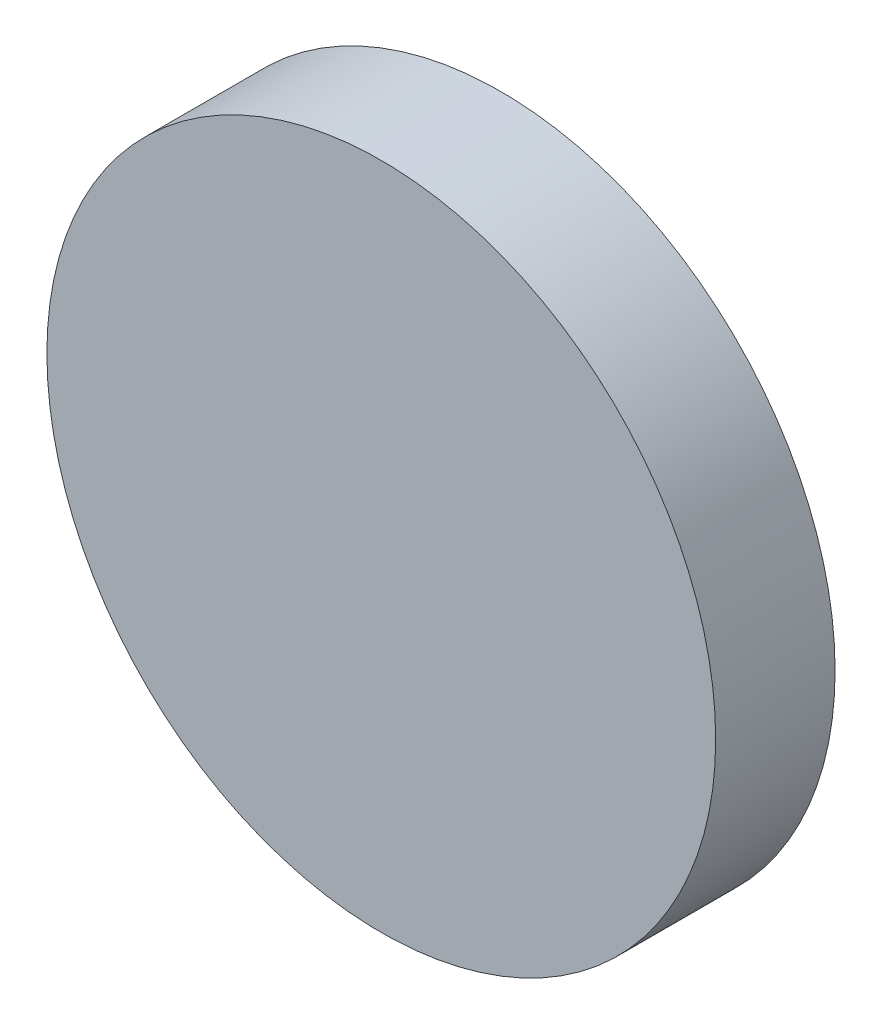
ISO-10303-21;
HEADER;
FILE_DESCRIPTION(('STEP AP214'),'2;1');
FILE_NAME('part.step','',(''),(''),'','','');
FILE_SCHEMA(('AUTOMOTIVE_DESIGN { 1 0 10303 214 1 1 1 1 }'));
ENDSEC;
DATA;
#1=APPLICATION_CONTEXT('core data for automotive mechanical design processes');
#2=APPLICATION_PROTOCOL_DEFINITION('international standard','automotive_design',2000,#1);
#3=PRODUCT_CONTEXT('',#1,'mechanical');
#4=PRODUCT('Part','Part','',(#3));
#5=PRODUCT_RELATED_PRODUCT_CATEGORY('part','',(#4));
#6=PRODUCT_DEFINITION_FORMATION('','',#4);
#7=PRODUCT_DEFINITION_CONTEXT('part definition',#1,'design');
#8=PRODUCT_DEFINITION('design','',#6,#7);
#9=PRODUCT_DEFINITION_SHAPE('','',#8);
#10=(LENGTH_UNIT() NAMED_UNIT(*) SI_UNIT(.MILLI.,.METRE.));
#11=(NAMED_UNIT(*) PLANE_ANGLE_UNIT() SI_UNIT($,.RADIAN.));
#12=(NAMED_UNIT(*) SI_UNIT($,.STERADIAN.) SOLID_ANGLE_UNIT());
#13=UNCERTAINTY_MEASURE_WITH_UNIT(LENGTH_MEASURE(1.E-05),#10,'distance_accuracy_value','');
#14=(GEOMETRIC_REPRESENTATION_CONTEXT(3) GLOBAL_UNCERTAINTY_ASSIGNED_CONTEXT((#13)) GLOBAL_UNIT_ASSIGNED_CONTEXT((#10,
#11,#12)) REPRESENTATION_CONTEXT('',''));
#15=CARTESIAN_POINT('',(0.,0.,0.));
#16=DIRECTION('',(0.,0.,1.));
#17=DIRECTION('',(1.,0.,0.));
#18=AXIS2_PLACEMENT_3D('',#15,#16,#17);
#19=CARTESIAN_POINT('',(0.,0.,-48.2102458339995));
#20=DIRECTION('',(0.,0.,1.));
#21=DIRECTION('',(1.,0.,0.));
#22=AXIS2_PLACEMENT_3D('',#19,#20,#21);
#23=PLANE('',#22);
#24=CARTESIAN_POINT('',(0.,0.,-48.2102458339995));
#25=DIRECTION('',(0.,0.,-1.));
#26=DIRECTION('',(-1.,0.,0.));
#27=AXIS2_PLACEMENT_3D('',#24,#25,#26);
#28=CIRCLE('',#27,10.);
#29=CARTESIAN_POINT('',(-10.,0.,-48.2102458339995));
#30=VERTEX_POINT('',#29);
#31=EDGE_CURVE('E11',#30,#30,#28,.T.);
#32=ORIENTED_EDGE('',*,*,#31,.F.);
#33=EDGE_LOOP('',(#32));
#34=FACE_BOUND('',#33,.T.);
#35=CARTESIAN_POINT('',(0.,0.,-48.2102458339995));
#36=DIRECTION('',(0.,0.,-1.));
#37=DIRECTION('',(-1.,0.,0.));
#38=AXIS2_PLACEMENT_3D('',#35,#36,#37);
#39=CIRCLE('',#38,12.);
#40=CARTESIAN_POINT('',(-12.,0.,-48.2102458339995));
#41=VERTEX_POINT('',#40);
#42=EDGE_CURVE('E192',#41,#41,#39,.T.);
#43=ORIENTED_EDGE('',*,*,#42,.T.);
#44=EDGE_LOOP('',(#43));
#45=FACE_BOUND('',#44,.T.);
#46=ADVANCED_FACE('F45',(#34,#45),#23,.F.);
#47=CARTESIAN_POINT('',(0.,0.,-58.0082048051322));
#48=DIRECTION('',(0.,0.,-1.));
#49=DIRECTION('',(1.,0.,0.));
#50=AXIS2_PLACEMENT_3D('',#47,#48,#49);
#51=SPHERICAL_SURFACE('',#50,14.);
#52=ORIENTED_EDGE('',*,*,#31,.T.);
#53=EDGE_LOOP('',(#52));
#54=FACE_BOUND('',#53,.T.);
#55=ADVANCED_FACE('F305',(#54),#51,.F.);
#56=CARTESIAN_POINT('',(0.,0.,-43.7102458339995));
#57=DIRECTION('',(0.,0.,1.));
#58=DIRECTION('',(1.,0.,0.));
#59=AXIS2_PLACEMENT_3D('',#56,#57,#58);
#60=PLANE('',#59);
#61=CARTESIAN_POINT('',(0.,0.,-43.7102458339995));
#62=DIRECTION('',(0.,0.,-1.));
#63=DIRECTION('',(-1.,0.,0.));
#64=AXIS2_PLACEMENT_3D('',#61,#62,#63);
#65=CIRCLE('',#64,14.);
#66=CARTESIAN_POINT('',(-14.,0.,-43.7102458339995));
#67=VERTEX_POINT('',#66);
#68=EDGE_CURVE('E52',#67,#67,#65,.T.);
#69=ORIENTED_EDGE('',*,*,#68,.F.);
#70=EDGE_LOOP('',(#69));
#71=FACE_BOUND('',#70,.T.);
#72=ADVANCED_FACE('F303',(#71),#60,.T.);
#73=CARTESIAN_POINT('',(0.,0.,-48.7102458339995));
#74=DIRECTION('',(0.,0.,-1.));
#75=DIRECTION('',(-1.,0.,0.));
#76=AXIS2_PLACEMENT_3D('',#73,#74,#75);
#77=CYLINDRICAL_SURFACE('',#76,14.);
#78=ORIENTED_EDGE('',*,*,#68,.T.);
#79=EDGE_LOOP('',(#78));
#80=FACE_BOUND('',#79,.T.);
#81=CARTESIAN_POINT('',(0.,0.,-48.7102458339995));
#82=DIRECTION('',(0.,0.,-1.));
#83=DIRECTION('',(-1.,0.,0.));
#84=AXIS2_PLACEMENT_3D('',#81,#82,#83);
#85=CIRCLE('',#84,14.);
#86=CARTESIAN_POINT('',(-14.,0.,-48.7102458339995));
#87=VERTEX_POINT('',#86);
#88=EDGE_CURVE('E295',#87,#87,#85,.T.);
#89=ORIENTED_EDGE('',*,*,#88,.F.);
#90=EDGE_LOOP('',(#89));
#91=FACE_BOUND('',#90,.T.);
#92=ADVANCED_FACE('F300',(#80,#91),#77,.T.);
#93=CARTESIAN_POINT('',(0.,0.,-48.7102458339995));
#94=DIRECTION('',(0.,0.,-1.));
#95=DIRECTION('',(-1.,0.,0.));
#96=AXIS2_PLACEMENT_3D('',#93,#94,#95);
#97=PLANE('',#96);
#98=DIRECTION('',(0.,1.,0.));
#99=VECTOR('',#98,1.);
#100=CARTESIAN_POINT('',(12.4,-1.25,-48.7102458339995));
#101=LINE('',#100,#99);
#102=CARTESIAN_POINT('',(12.4,-1.25,-48.7102458339995));
#103=VERTEX_POINT('',#102);
#104=CARTESIAN_POINT('',(12.4,1.25,-48.7102458339995));
#105=VERTEX_POINT('',#104);
#106=EDGE_CURVE('E59',#103,#105,#101,.T.);
#107=ORIENTED_EDGE('',*,*,#106,.F.);
#108=DIRECTION('',(-1.,0.,0.));
#109=VECTOR('',#108,1.);
#110=CARTESIAN_POINT('',(13.6,-1.25,-48.7102458339995));
#111=LINE('',#110,#109);
#112=CARTESIAN_POINT('',(13.6,-1.25,-48.7102458339995));
#113=VERTEX_POINT('',#112);
#114=EDGE_CURVE('E177',#113,#103,#111,.T.);
#115=ORIENTED_EDGE('',*,*,#114,.F.);
#116=DIRECTION('',(0.,-1.,0.));
#117=VECTOR('',#116,1.);
#118=CARTESIAN_POINT('',(13.6,-1.25,-48.7102458339995));
#119=LINE('',#118,#117);
#120=CARTESIAN_POINT('',(13.6,1.25,-48.7102458339995));
#121=VERTEX_POINT('',#120);
#122=EDGE_CURVE('E180',#121,#113,#119,.T.);
#123=ORIENTED_EDGE('',*,*,#122,.F.);
#124=DIRECTION('',(1.,0.,0.));
#125=VECTOR('',#124,1.);
#126=CARTESIAN_POINT('',(13.6,1.25,-48.7102458339995));
#127=LINE('',#126,#125);
#128=EDGE_CURVE('E186',#105,#121,#127,.T.);
#129=ORIENTED_EDGE('',*,*,#128,.F.);
#130=EDGE_LOOP('',(#107,#115,#123,#129));
#131=FACE_BOUND('',#130,.T.);
#132=DIRECTION('',(0.,1.,0.));
#133=VECTOR('',#132,1.);
#134=CARTESIAN_POINT('',(-1.25000000000004,13.6,-48.7102458339995));
#135=LINE('',#134,#133);
#136=CARTESIAN_POINT('',(-1.25000000000004,12.4,-48.7102458339995));
#137=VERTEX_POINT('',#136);
#138=CARTESIAN_POINT('',(-1.25000000000004,13.6,-48.7102458339995));
#139=VERTEX_POINT('',#138);
#140=EDGE_CURVE('E67',#137,#139,#135,.T.);
#141=ORIENTED_EDGE('',*,*,#140,.F.);
#142=DIRECTION('',(-1.,0.,0.));
#143=VECTOR('',#142,1.);
#144=CARTESIAN_POINT('',(1.24999999999996,12.4,-48.7102458339995));
#145=LINE('',#144,#143);
#146=CARTESIAN_POINT('',(1.24999999999996,12.4,-48.7102458339995));
#147=VERTEX_POINT('',#146);
#148=EDGE_CURVE('E206',#147,#137,#145,.T.);
#149=ORIENTED_EDGE('',*,*,#148,.F.);
#150=DIRECTION('',(0.,-1.,0.));
#151=VECTOR('',#150,1.);
#152=CARTESIAN_POINT('',(1.24999999999996,13.6,-48.7102458339995));
#153=LINE('',#152,#151);
#154=CARTESIAN_POINT('',(1.24999999999996,13.6,-48.7102458339995));
#155=VERTEX_POINT('',#154);
#156=EDGE_CURVE('E209',#155,#147,#153,.T.);
#157=ORIENTED_EDGE('',*,*,#156,.F.);
#158=DIRECTION('',(1.,0.,0.));
#159=VECTOR('',#158,1.);
#160=CARTESIAN_POINT('',(1.24999999999996,13.6,-48.7102458339995));
#161=LINE('',#160,#159);
#162=EDGE_CURVE('E213',#139,#155,#161,.T.);
#163=ORIENTED_EDGE('',*,*,#162,.F.);
#164=EDGE_LOOP('',(#141,#149,#157,#163));
#165=FACE_BOUND('',#164,.T.);
#166=DIRECTION('',(-1.,0.,0.));
#167=VECTOR('',#166,1.);
#168=CARTESIAN_POINT('',(-13.6,-1.2500000000001,-48.7102458339995));
#169=LINE('',#168,#167);
#170=CARTESIAN_POINT('',(-12.4,-1.25000000000009,-48.7102458339995));
#171=VERTEX_POINT('',#170);
#172=CARTESIAN_POINT('',(-13.6,-1.2500000000001,-48.7102458339995));
#173=VERTEX_POINT('',#172);
#174=EDGE_CURVE('E205',#171,#173,#169,.T.);
#175=ORIENTED_EDGE('',*,*,#174,.F.);
#176=DIRECTION('',(0.,-1.,0.));
#177=VECTOR('',#176,1.);
#178=CARTESIAN_POINT('',(-12.4,1.24999999999991,-48.7102458339995));
#179=LINE('',#178,#177);
#180=CARTESIAN_POINT('',(-12.4,1.24999999999991,-48.7102458339995));
#181=VERTEX_POINT('',#180);
#182=EDGE_CURVE('E238',#181,#171,#179,.T.);
#183=ORIENTED_EDGE('',*,*,#182,.F.);
#184=DIRECTION('',(1.,0.,0.));
#185=VECTOR('',#184,1.);
#186=CARTESIAN_POINT('',(-13.6,1.2499999999999,-48.7102458339995));
#187=LINE('',#186,#185);
#188=CARTESIAN_POINT('',(-13.6,1.2499999999999,-48.7102458339995));
#189=VERTEX_POINT('',#188);
#190=EDGE_CURVE('E241',#189,#181,#187,.T.);
#191=ORIENTED_EDGE('',*,*,#190,.F.);
#192=DIRECTION('',(0.,1.,0.));
#193=VECTOR('',#192,1.);
#194=CARTESIAN_POINT('',(-13.6,1.2499999999999,-48.7102458339995));
#195=LINE('',#194,#193);
#196=EDGE_CURVE('E245',#173,#189,#195,.T.);
#197=ORIENTED_EDGE('',*,*,#196,.F.);
#198=EDGE_LOOP('',(#175,#183,#191,#197));
#199=FACE_BOUND('',#198,.T.);
#200=DIRECTION('',(0.,-1.,0.));
#201=VECTOR('',#200,1.);
#202=CARTESIAN_POINT('',(1.25000000000015,-13.6,-48.7102458339995));
#203=LINE('',#202,#201);
#204=CARTESIAN_POINT('',(1.25000000000014,-12.4,-48.7102458339995));
#205=VERTEX_POINT('',#204);
#206=CARTESIAN_POINT('',(1.25000000000015,-13.6,-48.7102458339995));
#207=VERTEX_POINT('',#206);
#208=EDGE_CURVE('E237',#205,#207,#203,.T.);
#209=ORIENTED_EDGE('',*,*,#208,.F.);
#210=DIRECTION('',(1.,0.,0.));
#211=VECTOR('',#210,1.);
#212=CARTESIAN_POINT('',(-1.24999999999986,-12.4,-48.7102458339995));
#213=LINE('',#212,#211);
#214=CARTESIAN_POINT('',(-1.24999999999986,-12.4,-48.7102458339995));
#215=VERTEX_POINT('',#214);
#216=EDGE_CURVE('E269',#215,#205,#213,.T.);
#217=ORIENTED_EDGE('',*,*,#216,.F.);
#218=DIRECTION('',(0.,1.,0.));
#219=VECTOR('',#218,1.);
#220=CARTESIAN_POINT('',(-1.24999999999985,-13.6,-48.7102458339995));
#221=LINE('',#220,#219);
#222=CARTESIAN_POINT('',(-1.24999999999985,-13.6,-48.7102458339995));
#223=VERTEX_POINT('',#222);
#224=EDGE_CURVE('E272',#223,#215,#221,.T.);
#225=ORIENTED_EDGE('',*,*,#224,.F.);
#226=DIRECTION('',(-1.,0.,0.));
#227=VECTOR('',#226,1.);
#228=CARTESIAN_POINT('',(-1.24999999999985,-13.6,-48.7102458339995));
#229=LINE('',#228,#227);
#230=EDGE_CURVE('E276',#207,#223,#229,.T.);
#231=ORIENTED_EDGE('',*,*,#230,.F.);
#232=EDGE_LOOP('',(#209,#217,#225,#231));
#233=FACE_BOUND('',#232,.T.);
#234=ORIENTED_EDGE('',*,*,#88,.T.);
#235=EDGE_LOOP('',(#234));
#236=FACE_BOUND('',#235,.T.);
#237=CARTESIAN_POINT('',(0.,0.,-48.7102458339995));
#238=DIRECTION('',(0.,0.,-1.));
#239=DIRECTION('',(-1.,0.,0.));
#240=AXIS2_PLACEMENT_3D('',#237,#238,#239);
#241=CIRCLE('',#240,12.);
#242=CARTESIAN_POINT('',(-12.,0.,-48.7102458339995));
#243=VERTEX_POINT('',#242);
#244=EDGE_CURVE('E292',#243,#243,#241,.T.);
#245=ORIENTED_EDGE('',*,*,#244,.F.);
#246=EDGE_LOOP('',(#245));
#247=FACE_BOUND('',#246,.T.);
#248=ADVANCED_FACE('F311',(#131,#165,#199,#233,#236,#247),#97,.T.);
#249=CARTESIAN_POINT('',(0.,0.,-48.7102458339995));
#250=DIRECTION('',(0.,0.,-1.));
#251=DIRECTION('',(-1.,0.,0.));
#252=AXIS2_PLACEMENT_3D('',#249,#250,#251);
#253=CYLINDRICAL_SURFACE('',#252,12.);
#254=ORIENTED_EDGE('',*,*,#42,.F.);
#255=EDGE_LOOP('',(#254));
#256=FACE_BOUND('',#255,.T.);
#257=ORIENTED_EDGE('',*,*,#244,.T.);
#258=EDGE_LOOP('',(#257));
#259=FACE_BOUND('',#258,.T.);
#260=ADVANCED_FACE('F322',(#256,#259),#253,.F.);
#261=CARTESIAN_POINT('',(1.25000000000015,-13.6,-44.7102458339995));
#262=DIRECTION('',(1.,0.,0.));
#263=DIRECTION('',(0.,1.,0.));
#264=AXIS2_PLACEMENT_3D('',#261,#262,#263);
#265=PLANE('',#264);
#266=ORIENTED_EDGE('',*,*,#208,.T.);
#267=DIRECTION('',(0.,0.,-1.));
#268=VECTOR('',#267,1.);
#269=CARTESIAN_POINT('',(1.25000000000015,-13.6,-44.7102458339995));
#270=LINE('',#269,#268);
#271=CARTESIAN_POINT('',(1.25000000000015,-13.6,-44.7102458339995));
#272=VERTEX_POINT('',#271);
#273=EDGE_CURVE('E259',#272,#207,#270,.T.);
#274=ORIENTED_EDGE('',*,*,#273,.F.);
#275=DIRECTION('',(0.,-1.,0.));
#276=VECTOR('',#275,1.);
#277=CARTESIAN_POINT('',(1.25000000000015,-13.6,-44.7102458339995));
#278=LINE('',#277,#276);
#279=CARTESIAN_POINT('',(1.25000000000014,-12.4,-44.7102458339995));
#280=VERTEX_POINT('',#279);
#281=EDGE_CURVE('E273',#280,#272,#278,.T.);
#282=ORIENTED_EDGE('',*,*,#281,.F.);
#283=DIRECTION('',(0.,0.,-1.));
#284=VECTOR('',#283,1.);
#285=CARTESIAN_POINT('',(1.25000000000014,-12.4,-44.7102458339995));
#286=LINE('',#285,#284);
#287=EDGE_CURVE('E267',#280,#205,#286,.T.);
#288=ORIENTED_EDGE('',*,*,#287,.T.);
#289=EDGE_LOOP('',(#266,#274,#282,#288));
#290=FACE_BOUND('',#289,.T.);
#291=ADVANCED_FACE('F325',(#290),#265,.F.);
#292=CARTESIAN_POINT('',(-1.24999999999986,-12.4,-44.7102458339995));
#293=DIRECTION('',(0.,1.,0.));
#294=DIRECTION('',(-1.,0.,0.));
#295=AXIS2_PLACEMENT_3D('',#292,#293,#294);
#296=PLANE('',#295);
#297=ORIENTED_EDGE('',*,*,#216,.T.);
#298=ORIENTED_EDGE('',*,*,#287,.F.);
#299=DIRECTION('',(1.,0.,0.));
#300=VECTOR('',#299,1.);
#301=CARTESIAN_POINT('',(-1.24999999999986,-12.4,-44.7102458339995));
#302=LINE('',#301,#300);
#303=CARTESIAN_POINT('',(-1.24999999999986,-12.4,-44.7102458339995));
#304=VERTEX_POINT('',#303);
#305=EDGE_CURVE('E262',#304,#280,#302,.T.);
#306=ORIENTED_EDGE('',*,*,#305,.F.);
#307=DIRECTION('',(0.,0.,-1.));
#308=VECTOR('',#307,1.);
#309=CARTESIAN_POINT('',(-1.24999999999986,-12.4,-44.7102458339995));
#310=LINE('',#309,#308);
#311=EDGE_CURVE('E265',#304,#215,#310,.T.);
#312=ORIENTED_EDGE('',*,*,#311,.T.);
#313=EDGE_LOOP('',(#297,#298,#306,#312));
#314=FACE_BOUND('',#313,.T.);
#315=ADVANCED_FACE('F343',(#314),#296,.F.);
#316=CARTESIAN_POINT('',(-1.24999999999985,-13.6,-44.7102458339995));
#317=DIRECTION('',(-1.,0.,0.));
#318=DIRECTION('',(0.,-1.,0.));
#319=AXIS2_PLACEMENT_3D('',#316,#317,#318);
#320=PLANE('',#319);
#321=ORIENTED_EDGE('',*,*,#224,.T.);
#322=ORIENTED_EDGE('',*,*,#311,.F.);
#323=DIRECTION('',(0.,1.,0.));
#324=VECTOR('',#323,1.);
#325=CARTESIAN_POINT('',(-1.24999999999985,-13.6,-44.7102458339995));
#326=LINE('',#325,#324);
#327=CARTESIAN_POINT('',(-1.24999999999985,-13.6,-44.7102458339995));
#328=VERTEX_POINT('',#327);
#329=EDGE_CURVE('E282',#328,#304,#326,.T.);
#330=ORIENTED_EDGE('',*,*,#329,.F.);
#331=DIRECTION('',(0.,0.,-1.));
#332=VECTOR('',#331,1.);
#333=CARTESIAN_POINT('',(-1.24999999999985,-13.6,-44.7102458339995));
#334=LINE('',#333,#332);
#335=EDGE_CURVE('E263',#328,#223,#334,.T.);
#336=ORIENTED_EDGE('',*,*,#335,.T.);
#337=EDGE_LOOP('',(#321,#322,#330,#336));
#338=FACE_BOUND('',#337,.T.);
#339=ADVANCED_FACE('F346',(#338),#320,.F.);
#340=CARTESIAN_POINT('',(-1.24999999999985,-13.6,-44.7102458339995));
#341=DIRECTION('',(0.,-1.,0.));
#342=DIRECTION('',(1.,0.,0.));
#343=AXIS2_PLACEMENT_3D('',#340,#341,#342);
#344=PLANE('',#343);
#345=ORIENTED_EDGE('',*,*,#230,.T.);
#346=ORIENTED_EDGE('',*,*,#335,.F.);
#347=DIRECTION('',(-1.,0.,0.));
#348=VECTOR('',#347,1.);
#349=CARTESIAN_POINT('',(-1.24999999999985,-13.6,-44.7102458339995));
#350=LINE('',#349,#348);
#351=EDGE_CURVE('E285',#272,#328,#350,.T.);
#352=ORIENTED_EDGE('',*,*,#351,.F.);
#353=ORIENTED_EDGE('',*,*,#273,.T.);
#354=EDGE_LOOP('',(#345,#346,#352,#353));
#355=FACE_BOUND('',#354,.T.);
#356=ADVANCED_FACE('F341',(#355),#344,.F.);
#357=CARTESIAN_POINT('',(0.,0.,-44.7102458339995));
#358=DIRECTION('',(0.,0.,-1.));
#359=DIRECTION('',(-1.,0.,0.));
#360=AXIS2_PLACEMENT_3D('',#357,#358,#359);
#361=PLANE('',#360);
#362=ORIENTED_EDGE('',*,*,#281,.T.);
#363=ORIENTED_EDGE('',*,*,#351,.T.);
#364=ORIENTED_EDGE('',*,*,#329,.T.);
#365=ORIENTED_EDGE('',*,*,#305,.T.);
#366=EDGE_LOOP('',(#362,#363,#364,#365));
#367=FACE_BOUND('',#366,.T.);
#368=ADVANCED_FACE('F337',(#367),#361,.T.);
#369=CARTESIAN_POINT('',(-13.6,-1.2500000000001,-44.7102458339995));
#370=DIRECTION('',(0.,-1.,0.));
#371=DIRECTION('',(1.,0.,0.));
#372=AXIS2_PLACEMENT_3D('',#369,#370,#371);
#373=PLANE('',#372);
#374=ORIENTED_EDGE('',*,*,#174,.T.);
#375=DIRECTION('',(0.,0.,-1.));
#376=VECTOR('',#375,1.);
#377=CARTESIAN_POINT('',(-13.6,-1.2500000000001,-44.7102458339995));
#378=LINE('',#377,#376);
#379=CARTESIAN_POINT('',(-13.6,-1.2500000000001,-44.7102458339995));
#380=VERTEX_POINT('',#379);
#381=EDGE_CURVE('E227',#380,#173,#378,.T.);
#382=ORIENTED_EDGE('',*,*,#381,.F.);
#383=DIRECTION('',(-1.,0.,0.));
#384=VECTOR('',#383,1.);
#385=CARTESIAN_POINT('',(-13.6,-1.2500000000001,-44.7102458339995));
#386=LINE('',#385,#384);
#387=CARTESIAN_POINT('',(-12.4,-1.25000000000009,-44.7102458339995));
#388=VERTEX_POINT('',#387);
#389=EDGE_CURVE('E242',#388,#380,#386,.T.);
#390=ORIENTED_EDGE('',*,*,#389,.F.);
#391=DIRECTION('',(0.,0.,-1.));
#392=VECTOR('',#391,1.);
#393=CARTESIAN_POINT('',(-12.4,-1.25000000000009,-44.7102458339995));
#394=LINE('',#393,#392);
#395=EDGE_CURVE('E235',#388,#171,#394,.T.);
#396=ORIENTED_EDGE('',*,*,#395,.T.);
#397=EDGE_LOOP('',(#374,#382,#390,#396));
#398=FACE_BOUND('',#397,.T.);
#399=ADVANCED_FACE('F340',(#398),#373,.F.);
#400=CARTESIAN_POINT('',(-12.4,1.24999999999991,-44.7102458339995));
#401=DIRECTION('',(1.,0.,0.));
#402=DIRECTION('',(0.,1.,0.));
#403=AXIS2_PLACEMENT_3D('',#400,#401,#402);
#404=PLANE('',#403);
#405=ORIENTED_EDGE('',*,*,#182,.T.);
#406=ORIENTED_EDGE('',*,*,#395,.F.);
#407=DIRECTION('',(0.,-1.,0.));
#408=VECTOR('',#407,1.);
#409=CARTESIAN_POINT('',(-12.4,1.24999999999991,-44.7102458339995));
#410=LINE('',#409,#408);
#411=CARTESIAN_POINT('',(-12.4,1.24999999999991,-44.7102458339995));
#412=VERTEX_POINT('',#411);
#413=EDGE_CURVE('E230',#412,#388,#410,.T.);
#414=ORIENTED_EDGE('',*,*,#413,.F.);
#415=DIRECTION('',(0.,0.,-1.));
#416=VECTOR('',#415,1.);
#417=CARTESIAN_POINT('',(-12.4,1.24999999999991,-44.7102458339995));
#418=LINE('',#417,#416);
#419=EDGE_CURVE('E233',#412,#181,#418,.T.);
#420=ORIENTED_EDGE('',*,*,#419,.T.);
#421=EDGE_LOOP('',(#405,#406,#414,#420));
#422=FACE_BOUND('',#421,.T.);
#423=ADVANCED_FACE('F362',(#422),#404,.F.);
#424=CARTESIAN_POINT('',(-13.6,1.2499999999999,-44.7102458339995));
#425=DIRECTION('',(0.,1.,0.));
#426=DIRECTION('',(-1.,0.,0.));
#427=AXIS2_PLACEMENT_3D('',#424,#425,#426);
#428=PLANE('',#427);
#429=ORIENTED_EDGE('',*,*,#190,.T.);
#430=ORIENTED_EDGE('',*,*,#419,.F.);
#431=DIRECTION('',(1.,0.,0.));
#432=VECTOR('',#431,1.);
#433=CARTESIAN_POINT('',(-13.6,1.2499999999999,-44.7102458339995));
#434=LINE('',#433,#432);
#435=CARTESIAN_POINT('',(-13.6,1.2499999999999,-44.7102458339995));
#436=VERTEX_POINT('',#435);
#437=EDGE_CURVE('E251',#436,#412,#434,.T.);
#438=ORIENTED_EDGE('',*,*,#437,.F.);
#439=DIRECTION('',(0.,0.,-1.));
#440=VECTOR('',#439,1.);
#441=CARTESIAN_POINT('',(-13.6,1.2499999999999,-44.7102458339995));
#442=LINE('',#441,#440);
#443=EDGE_CURVE('E231',#436,#189,#442,.T.);
#444=ORIENTED_EDGE('',*,*,#443,.T.);
#445=EDGE_LOOP('',(#429,#430,#438,#444));
#446=FACE_BOUND('',#445,.T.);
#447=ADVANCED_FACE('F365',(#446),#428,.F.);
#448=CARTESIAN_POINT('',(-13.6,1.2499999999999,-44.7102458339995));
#449=DIRECTION('',(-1.,0.,0.));
#450=DIRECTION('',(0.,-1.,0.));
#451=AXIS2_PLACEMENT_3D('',#448,#449,#450);
#452=PLANE('',#451);
#453=ORIENTED_EDGE('',*,*,#196,.T.);
#454=ORIENTED_EDGE('',*,*,#443,.F.);
#455=DIRECTION('',(0.,1.,0.));
#456=VECTOR('',#455,1.);
#457=CARTESIAN_POINT('',(-13.6,1.2499999999999,-44.7102458339995));
#458=LINE('',#457,#456);
#459=EDGE_CURVE('E254',#380,#436,#458,.T.);
#460=ORIENTED_EDGE('',*,*,#459,.F.);
#461=ORIENTED_EDGE('',*,*,#381,.T.);
#462=EDGE_LOOP('',(#453,#454,#460,#461));
#463=FACE_BOUND('',#462,.T.);
#464=ADVANCED_FACE('F360',(#463),#452,.F.);
#465=CARTESIAN_POINT('',(0.,0.,-44.7102458339995));
#466=DIRECTION('',(0.,0.,-1.));
#467=DIRECTION('',(-1.,0.,0.));
#468=AXIS2_PLACEMENT_3D('',#465,#466,#467);
#469=PLANE('',#468);
#470=ORIENTED_EDGE('',*,*,#389,.T.);
#471=ORIENTED_EDGE('',*,*,#459,.T.);
#472=ORIENTED_EDGE('',*,*,#437,.T.);
#473=ORIENTED_EDGE('',*,*,#413,.T.);
#474=EDGE_LOOP('',(#470,#471,#472,#473));
#475=FACE_BOUND('',#474,.T.);
#476=ADVANCED_FACE('F356',(#475),#469,.T.);
#477=CARTESIAN_POINT('',(-1.25000000000004,13.6,-44.7102458339995));
#478=DIRECTION('',(-1.,0.,0.));
#479=DIRECTION('',(0.,-1.,0.));
#480=AXIS2_PLACEMENT_3D('',#477,#478,#479);
#481=PLANE('',#480);
#482=ORIENTED_EDGE('',*,*,#140,.T.);
#483=DIRECTION('',(0.,0.,-1.));
#484=VECTOR('',#483,1.);
#485=CARTESIAN_POINT('',(-1.25000000000004,13.6,-44.7102458339995));
#486=LINE('',#485,#484);
#487=CARTESIAN_POINT('',(-1.25000000000004,13.6,-44.7102458339995));
#488=VERTEX_POINT('',#487);
#489=EDGE_CURVE('E196',#488,#139,#486,.T.);
#490=ORIENTED_EDGE('',*,*,#489,.F.);
#491=DIRECTION('',(0.,1.,0.));
#492=VECTOR('',#491,1.);
#493=CARTESIAN_POINT('',(-1.25000000000004,13.6,-44.7102458339995));
#494=LINE('',#493,#492);
#495=CARTESIAN_POINT('',(-1.25000000000004,12.4,-44.7102458339995));
#496=VERTEX_POINT('',#495);
#497=EDGE_CURVE('E210',#496,#488,#494,.T.);
#498=ORIENTED_EDGE('',*,*,#497,.F.);
#499=DIRECTION('',(0.,0.,-1.));
#500=VECTOR('',#499,1.);
#501=CARTESIAN_POINT('',(-1.25000000000004,12.4,-44.7102458339995));
#502=LINE('',#501,#500);
#503=EDGE_CURVE('E203',#496,#137,#502,.T.);
#504=ORIENTED_EDGE('',*,*,#503,.T.);
#505=EDGE_LOOP('',(#482,#490,#498,#504));
#506=FACE_BOUND('',#505,.T.);
#507=ADVANCED_FACE('F359',(#506),#481,.F.);
#508=CARTESIAN_POINT('',(1.24999999999996,12.4,-44.7102458339995));
#509=DIRECTION('',(0.,-1.,0.));
#510=DIRECTION('',(1.,0.,0.));
#511=AXIS2_PLACEMENT_3D('',#508,#509,#510);
#512=PLANE('',#511);
#513=ORIENTED_EDGE('',*,*,#148,.T.);
#514=ORIENTED_EDGE('',*,*,#503,.F.);
#515=DIRECTION('',(-1.,0.,0.));
#516=VECTOR('',#515,1.);
#517=CARTESIAN_POINT('',(1.24999999999996,12.4,-44.7102458339995));
#518=LINE('',#517,#516);
#519=CARTESIAN_POINT('',(1.24999999999996,12.4,-44.7102458339995));
#520=VERTEX_POINT('',#519);
#521=EDGE_CURVE('E198',#520,#496,#518,.T.);
#522=ORIENTED_EDGE('',*,*,#521,.F.);
#523=DIRECTION('',(0.,0.,-1.));
#524=VECTOR('',#523,1.);
#525=CARTESIAN_POINT('',(1.24999999999996,12.4,-44.7102458339995));
#526=LINE('',#525,#524);
#527=EDGE_CURVE('E201',#520,#147,#526,.T.);
#528=ORIENTED_EDGE('',*,*,#527,.T.);
#529=EDGE_LOOP('',(#513,#514,#522,#528));
#530=FACE_BOUND('',#529,.T.);
#531=ADVANCED_FACE('F381',(#530),#512,.F.);
#532=CARTESIAN_POINT('',(1.24999999999996,13.6,-44.7102458339995));
#533=DIRECTION('',(1.,0.,0.));
#534=DIRECTION('',(0.,1.,0.));
#535=AXIS2_PLACEMENT_3D('',#532,#533,#534);
#536=PLANE('',#535);
#537=ORIENTED_EDGE('',*,*,#156,.T.);
#538=ORIENTED_EDGE('',*,*,#527,.F.);
#539=DIRECTION('',(0.,-1.,0.));
#540=VECTOR('',#539,1.);
#541=CARTESIAN_POINT('',(1.24999999999996,13.6,-44.7102458339995));
#542=LINE('',#541,#540);
#543=CARTESIAN_POINT('',(1.24999999999996,13.6,-44.7102458339995));
#544=VERTEX_POINT('',#543);
#545=EDGE_CURVE('E219',#544,#520,#542,.T.);
#546=ORIENTED_EDGE('',*,*,#545,.F.);
#547=DIRECTION('',(0.,0.,-1.));
#548=VECTOR('',#547,1.);
#549=CARTESIAN_POINT('',(1.24999999999996,13.6,-44.7102458339995));
#550=LINE('',#549,#548);
#551=EDGE_CURVE('E199',#544,#155,#550,.T.);
#552=ORIENTED_EDGE('',*,*,#551,.T.);
#553=EDGE_LOOP('',(#537,#538,#546,#552));
#554=FACE_BOUND('',#553,.T.);
#555=ADVANCED_FACE('F384',(#554),#536,.F.);
#556=CARTESIAN_POINT('',(1.24999999999996,13.6,-44.7102458339995));
#557=DIRECTION('',(0.,1.,0.));
#558=DIRECTION('',(-1.,0.,0.));
#559=AXIS2_PLACEMENT_3D('',#556,#557,#558);
#560=PLANE('',#559);
#561=ORIENTED_EDGE('',*,*,#162,.T.);
#562=ORIENTED_EDGE('',*,*,#551,.F.);
#563=DIRECTION('',(1.,0.,0.));
#564=VECTOR('',#563,1.);
#565=CARTESIAN_POINT('',(1.24999999999996,13.6,-44.7102458339995));
#566=LINE('',#565,#564);
#567=EDGE_CURVE('E222',#488,#544,#566,.T.);
#568=ORIENTED_EDGE('',*,*,#567,.F.);
#569=ORIENTED_EDGE('',*,*,#489,.T.);
#570=EDGE_LOOP('',(#561,#562,#568,#569));
#571=FACE_BOUND('',#570,.T.);
#572=ADVANCED_FACE('F379',(#571),#560,.F.);
#573=CARTESIAN_POINT('',(0.,0.,-44.7102458339995));
#574=DIRECTION('',(0.,0.,-1.));
#575=DIRECTION('',(-1.,0.,0.));
#576=AXIS2_PLACEMENT_3D('',#573,#574,#575);
#577=PLANE('',#576);
#578=ORIENTED_EDGE('',*,*,#497,.T.);
#579=ORIENTED_EDGE('',*,*,#567,.T.);
#580=ORIENTED_EDGE('',*,*,#545,.T.);
#581=ORIENTED_EDGE('',*,*,#521,.T.);
#582=EDGE_LOOP('',(#578,#579,#580,#581));
#583=FACE_BOUND('',#582,.T.);
#584=ADVANCED_FACE('F376',(#583),#577,.T.);
#585=CARTESIAN_POINT('',(12.4,-1.25,-44.7102458339995));
#586=DIRECTION('',(-1.,0.,0.));
#587=DIRECTION('',(0.,0.,1.));
#588=AXIS2_PLACEMENT_3D('',#585,#586,#587);
#589=PLANE('',#588);
#590=ORIENTED_EDGE('',*,*,#106,.T.);
#591=DIRECTION('',(0.,0.,-1.));
#592=VECTOR('',#591,1.);
#593=CARTESIAN_POINT('',(12.4,1.25,-44.7102458339995));
#594=LINE('',#593,#592);
#595=CARTESIAN_POINT('',(12.4,1.25,-44.7102458339995));
#596=VERTEX_POINT('',#595);
#597=EDGE_CURVE('E155',#596,#105,#594,.T.);
#598=ORIENTED_EDGE('',*,*,#597,.F.);
#599=DIRECTION('',(0.,1.,0.));
#600=VECTOR('',#599,1.);
#601=CARTESIAN_POINT('',(12.4,-1.25,-44.7102458339995));
#602=LINE('',#601,#600);
#603=CARTESIAN_POINT('',(12.4,-1.25,-44.7102458339995));
#604=VERTEX_POINT('',#603);
#605=EDGE_CURVE('E159',#604,#596,#602,.T.);
#606=ORIENTED_EDGE('',*,*,#605,.F.);
#607=DIRECTION('',(0.,0.,-1.));
#608=VECTOR('',#607,1.);
#609=CARTESIAN_POINT('',(12.4,-1.25,-44.7102458339995));
#610=LINE('',#609,#608);
#611=EDGE_CURVE('E190',#604,#103,#610,.T.);
#612=ORIENTED_EDGE('',*,*,#611,.T.);
#613=EDGE_LOOP('',(#590,#598,#606,#612));
#614=FACE_BOUND('',#613,.T.);
#615=ADVANCED_FACE('F157',(#614),#589,.F.);
#616=CARTESIAN_POINT('',(13.6,-1.25,-44.7102458339995));
#617=DIRECTION('',(0.,-1.,0.));
#618=DIRECTION('',(0.,0.,-1.));
#619=AXIS2_PLACEMENT_3D('',#616,#617,#618);
#620=PLANE('',#619);
#621=ORIENTED_EDGE('',*,*,#114,.T.);
#622=ORIENTED_EDGE('',*,*,#611,.F.);
#623=DIRECTION('',(-1.,0.,0.));
#624=VECTOR('',#623,1.);
#625=CARTESIAN_POINT('',(13.6,-1.25,-44.7102458339995));
#626=LINE('',#625,#624);
#627=CARTESIAN_POINT('',(13.6,-1.25,-44.7102458339995));
#628=VERTEX_POINT('',#627);
#629=EDGE_CURVE('E165',#628,#604,#626,.T.);
#630=ORIENTED_EDGE('',*,*,#629,.F.);
#631=DIRECTION('',(0.,0.,-1.));
#632=VECTOR('',#631,1.);
#633=CARTESIAN_POINT('',(13.6,-1.25,-44.7102458339995));
#634=LINE('',#633,#632);
#635=EDGE_CURVE('E193',#628,#113,#634,.T.);
#636=ORIENTED_EDGE('',*,*,#635,.T.);
#637=EDGE_LOOP('',(#621,#622,#630,#636));
#638=FACE_BOUND('',#637,.T.);
#639=ADVANCED_FACE('F396',(#638),#620,.F.);
#640=CARTESIAN_POINT('',(13.6,-1.25,-44.7102458339995));
#641=DIRECTION('',(1.,0.,0.));
#642=DIRECTION('',(0.,0.,-1.));
#643=AXIS2_PLACEMENT_3D('',#640,#641,#642);
#644=PLANE('',#643);
#645=ORIENTED_EDGE('',*,*,#122,.T.);
#646=ORIENTED_EDGE('',*,*,#635,.F.);
#647=DIRECTION('',(0.,-1.,0.));
#648=VECTOR('',#647,1.);
#649=CARTESIAN_POINT('',(13.6,-1.25,-44.7102458339995));
#650=LINE('',#649,#648);
#651=CARTESIAN_POINT('',(13.6,1.25,-44.7102458339995));
#652=VERTEX_POINT('',#651);
#653=EDGE_CURVE('E173',#652,#628,#650,.T.);
#654=ORIENTED_EDGE('',*,*,#653,.F.);
#655=DIRECTION('',(0.,0.,-1.));
#656=VECTOR('',#655,1.);
#657=CARTESIAN_POINT('',(13.6,1.25,-44.7102458339995));
#658=LINE('',#657,#656);
#659=EDGE_CURVE('E164',#652,#121,#658,.T.);
#660=ORIENTED_EDGE('',*,*,#659,.T.);
#661=EDGE_LOOP('',(#645,#646,#654,#660));
#662=FACE_BOUND('',#661,.T.);
#663=ADVANCED_FACE('F399',(#662),#644,.F.);
#664=CARTESIAN_POINT('',(13.6,1.25,-44.7102458339995));
#665=DIRECTION('',(0.,1.,0.));
#666=DIRECTION('',(0.,0.,1.));
#667=AXIS2_PLACEMENT_3D('',#664,#665,#666);
#668=PLANE('',#667);
#669=ORIENTED_EDGE('',*,*,#128,.T.);
#670=ORIENTED_EDGE('',*,*,#659,.F.);
#671=DIRECTION('',(1.,0.,0.));
#672=VECTOR('',#671,1.);
#673=CARTESIAN_POINT('',(13.6,1.25,-44.7102458339995));
#674=LINE('',#673,#672);
#675=EDGE_CURVE('E168',#596,#652,#674,.T.);
#676=ORIENTED_EDGE('',*,*,#675,.F.);
#677=ORIENTED_EDGE('',*,*,#597,.T.);
#678=EDGE_LOOP('',(#669,#670,#676,#677));
#679=FACE_BOUND('',#678,.T.);
#680=ADVANCED_FACE('F169',(#679),#668,.F.);
#681=CARTESIAN_POINT('',(0.,0.,-44.7102458339995));
#682=DIRECTION('',(0.,0.,1.));
#683=DIRECTION('',(1.,0.,0.));
#684=AXIS2_PLACEMENT_3D('',#681,#682,#683);
#685=PLANE('',#684);
#686=ORIENTED_EDGE('',*,*,#605,.T.);
#687=ORIENTED_EDGE('',*,*,#675,.T.);
#688=ORIENTED_EDGE('',*,*,#653,.T.);
#689=ORIENTED_EDGE('',*,*,#629,.T.);
#690=EDGE_LOOP('',(#686,#687,#688,#689));
#691=FACE_BOUND('',#690,.T.);
#692=ADVANCED_FACE('F175',(#691),#685,.F.);
#693=CLOSED_SHELL('',(#46,#55,#72,#92,#248,#260,#291,#315,#339,#356,#368,#399,#423,#447,#464,
#476,#507,#531,#555,#572,#584,#615,#639,#663,#680,#692));
#694=MANIFOLD_SOLID_BREP('B2',#693);
#695=ADVANCED_BREP_SHAPE_REPRESENTATION('',(#18,#694),#14);
#696=SHAPE_DEFINITION_REPRESENTATION(#9,#695);
ENDSEC;
END-ISO-10303-21;
